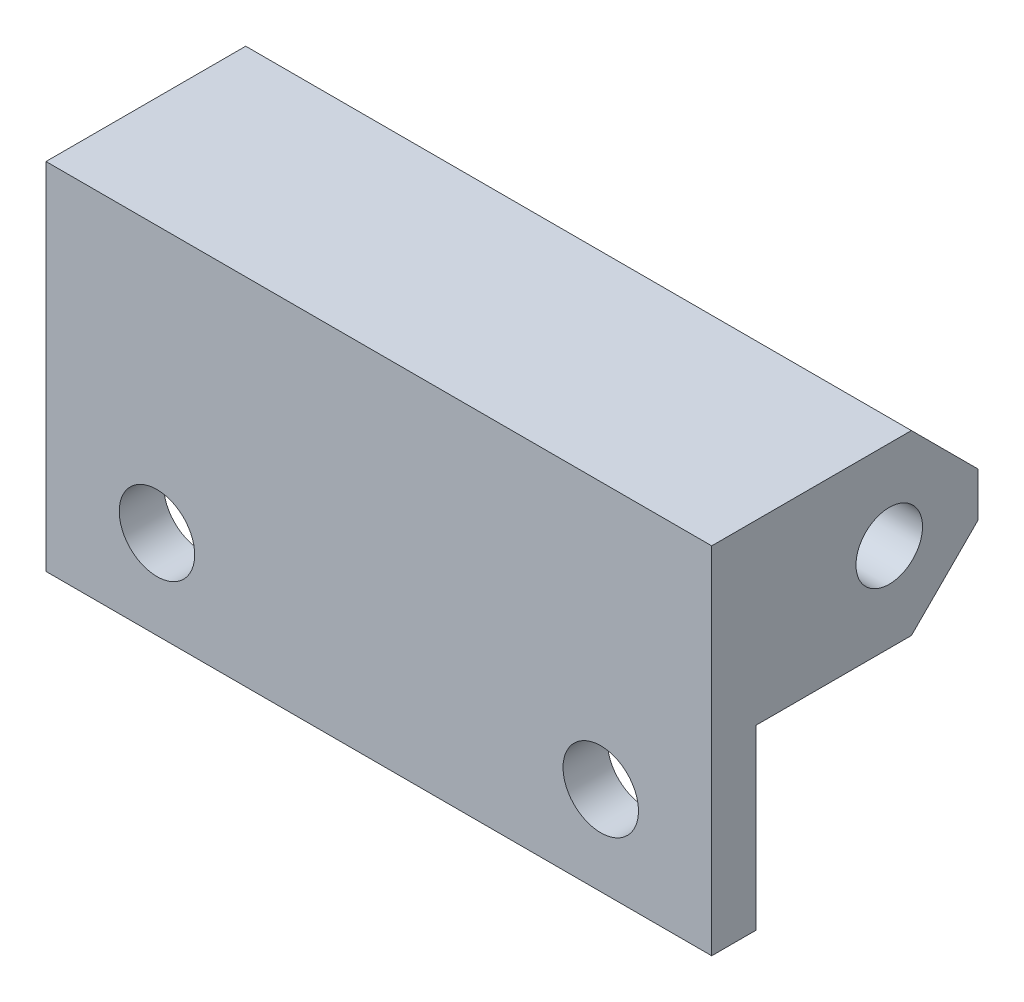
ISO-10303-21;
HEADER;
FILE_DESCRIPTION(('STEP AP214'),'2;1');
FILE_NAME('part.step','',(''),(''),'','','');
FILE_SCHEMA(('AUTOMOTIVE_DESIGN { 1 0 10303 214 1 1 1 1 }'));
ENDSEC;
DATA;
#1=APPLICATION_CONTEXT('core data for automotive mechanical design processes');
#2=APPLICATION_PROTOCOL_DEFINITION('international standard','automotive_design',2000,#1);
#3=PRODUCT_CONTEXT('',#1,'mechanical');
#4=PRODUCT('Part','Part','',(#3));
#5=PRODUCT_RELATED_PRODUCT_CATEGORY('part','',(#4));
#6=PRODUCT_DEFINITION_FORMATION('','',#4);
#7=PRODUCT_DEFINITION_CONTEXT('part definition',#1,'design');
#8=PRODUCT_DEFINITION('design','',#6,#7);
#9=PRODUCT_DEFINITION_SHAPE('','',#8);
#10=(LENGTH_UNIT() NAMED_UNIT(*) SI_UNIT(.MILLI.,.METRE.));
#11=(NAMED_UNIT(*) PLANE_ANGLE_UNIT() SI_UNIT($,.RADIAN.));
#12=(NAMED_UNIT(*) SI_UNIT($,.STERADIAN.) SOLID_ANGLE_UNIT());
#13=UNCERTAINTY_MEASURE_WITH_UNIT(LENGTH_MEASURE(1.E-05),#10,'distance_accuracy_value','');
#14=(GEOMETRIC_REPRESENTATION_CONTEXT(3) GLOBAL_UNCERTAINTY_ASSIGNED_CONTEXT((#13)) GLOBAL_UNIT_ASSIGNED_CONTEXT((#10,
#11,#12)) REPRESENTATION_CONTEXT('',''));
#15=CARTESIAN_POINT('',(0.,0.,0.));
#16=DIRECTION('',(0.,0.,1.));
#17=DIRECTION('',(1.,0.,0.));
#18=AXIS2_PLACEMENT_3D('',#15,#16,#17);
#19=CARTESIAN_POINT('',(15.,3.,-4.));
#20=DIRECTION('',(0.,-0.707106781186547,-0.707106781186548));
#21=DIRECTION('',(0.,0.707106781186548,-0.707106781186547));
#22=AXIS2_PLACEMENT_3D('',#19,#20,#21);
#23=PLANE('',#22);
#24=DIRECTION('',(0.,-0.707106781186548,0.707106781186547));
#25=VECTOR('',#24,1.);
#26=CARTESIAN_POINT('',(-15.,3.,-4.));
#27=LINE('',#26,#25);
#28=CARTESIAN_POINT('',(-15.,3.,-4.));
#29=VERTEX_POINT('',#28);
#30=CARTESIAN_POINT('',(-15.,0.,-1.));
#31=VERTEX_POINT('',#30);
#32=EDGE_CURVE('E144',#29,#31,#27,.T.);
#33=ORIENTED_EDGE('',*,*,#32,.F.);
#34=DIRECTION('',(-1.,0.,0.));
#35=VECTOR('',#34,1.);
#36=CARTESIAN_POINT('',(15.,3.,-4.));
#37=LINE('',#36,#35);
#38=CARTESIAN_POINT('',(15.,3.,-4.));
#39=VERTEX_POINT('',#38);
#40=EDGE_CURVE('E42',#39,#29,#37,.T.);
#41=ORIENTED_EDGE('',*,*,#40,.F.);
#42=DIRECTION('',(0.,-0.707106781186548,0.707106781186547));
#43=VECTOR('',#42,1.);
#44=CARTESIAN_POINT('',(15.,3.,-4.));
#45=LINE('',#44,#43);
#46=CARTESIAN_POINT('',(15.,0.,-1.));
#47=VERTEX_POINT('',#46);
#48=EDGE_CURVE('E116',#39,#47,#45,.T.);
#49=ORIENTED_EDGE('',*,*,#48,.T.);
#50=DIRECTION('',(-1.,0.,0.));
#51=VECTOR('',#50,1.);
#52=CARTESIAN_POINT('',(15.,0.,-1.));
#53=LINE('',#52,#51);
#54=EDGE_CURVE('E11',#47,#31,#53,.T.);
#55=ORIENTED_EDGE('',*,*,#54,.T.);
#56=EDGE_LOOP('',(#33,#41,#49,#55));
#57=FACE_BOUND('',#56,.T.);
#58=ADVANCED_FACE('F32',(#57),#23,.T.);
#59=CARTESIAN_POINT('',(15.,5.,-4.));
#60=DIRECTION('',(0.,0.,-1.));
#61=DIRECTION('',(0.,1.,0.));
#62=AXIS2_PLACEMENT_3D('',#59,#60,#61);
#63=PLANE('',#62);
#64=DIRECTION('',(0.,-1.,0.));
#65=VECTOR('',#64,1.);
#66=CARTESIAN_POINT('',(-15.,5.,-4.));
#67=LINE('',#66,#65);
#68=CARTESIAN_POINT('',(-15.,5.,-4.));
#69=VERTEX_POINT('',#68);
#70=EDGE_CURVE('E103',#69,#29,#67,.T.);
#71=ORIENTED_EDGE('',*,*,#70,.F.);
#72=DIRECTION('',(-1.,0.,0.));
#73=VECTOR('',#72,1.);
#74=CARTESIAN_POINT('',(15.,5.,-4.));
#75=LINE('',#74,#73);
#76=CARTESIAN_POINT('',(15.,5.,-4.));
#77=VERTEX_POINT('',#76);
#78=EDGE_CURVE('E98',#77,#69,#75,.T.);
#79=ORIENTED_EDGE('',*,*,#78,.F.);
#80=DIRECTION('',(0.,-1.,0.));
#81=VECTOR('',#80,1.);
#82=CARTESIAN_POINT('',(15.,5.,-4.));
#83=LINE('',#82,#81);
#84=EDGE_CURVE('E101',#77,#39,#83,.T.);
#85=ORIENTED_EDGE('',*,*,#84,.T.);
#86=ORIENTED_EDGE('',*,*,#40,.T.);
#87=EDGE_LOOP('',(#71,#79,#85,#86));
#88=FACE_BOUND('',#87,.T.);
#89=ADVANCED_FACE('F100',(#88),#63,.T.);
#90=CARTESIAN_POINT('',(15.,8.,-0.999999999999999));
#91=DIRECTION('',(0.,0.707106781186547,-0.707106781186547));
#92=DIRECTION('',(0.,0.707106781186548,0.707106781186548));
#93=AXIS2_PLACEMENT_3D('',#90,#91,#92);
#94=PLANE('',#93);
#95=DIRECTION('',(0.,-0.707106781186548,-0.707106781186548));
#96=VECTOR('',#95,1.);
#97=CARTESIAN_POINT('',(-15.,8.,-0.999999999999999));
#98=LINE('',#97,#96);
#99=CARTESIAN_POINT('',(-15.,8.,-0.999999999999999));
#100=VERTEX_POINT('',#99);
#101=EDGE_CURVE('E141',#100,#69,#98,.T.);
#102=ORIENTED_EDGE('',*,*,#101,.F.);
#103=DIRECTION('',(-1.,0.,0.));
#104=VECTOR('',#103,1.);
#105=CARTESIAN_POINT('',(15.,8.,-0.999999999999999));
#106=LINE('',#105,#104);
#107=CARTESIAN_POINT('',(15.,8.,-0.999999999999999));
#108=VERTEX_POINT('',#107);
#109=EDGE_CURVE('E108',#108,#100,#106,.T.);
#110=ORIENTED_EDGE('',*,*,#109,.F.);
#111=DIRECTION('',(0.,-0.707106781186548,-0.707106781186548));
#112=VECTOR('',#111,1.);
#113=CARTESIAN_POINT('',(15.,8.,-0.999999999999999));
#114=LINE('',#113,#112);
#115=EDGE_CURVE('E114',#108,#77,#114,.T.);
#116=ORIENTED_EDGE('',*,*,#115,.T.);
#117=ORIENTED_EDGE('',*,*,#78,.T.);
#118=EDGE_LOOP('',(#102,#110,#116,#117));
#119=FACE_BOUND('',#118,.T.);
#120=ADVANCED_FACE('F119',(#119),#94,.T.);
#121=CARTESIAN_POINT('',(15.,8.,0.));
#122=DIRECTION('',(0.,1.,0.));
#123=DIRECTION('',(0.,0.,1.));
#124=AXIS2_PLACEMENT_3D('',#121,#122,#123);
#125=PLANE('',#124);
#126=DIRECTION('',(0.,0.,-1.));
#127=VECTOR('',#126,1.);
#128=CARTESIAN_POINT('',(-15.,8.,0.));
#129=LINE('',#128,#127);
#130=CARTESIAN_POINT('',(-15.,8.,8.));
#131=VERTEX_POINT('',#130);
#132=EDGE_CURVE('E138',#131,#100,#129,.T.);
#133=ORIENTED_EDGE('',*,*,#132,.F.);
#134=DIRECTION('',(-1.,0.,0.));
#135=VECTOR('',#134,1.);
#136=CARTESIAN_POINT('',(15.,8.,8.));
#137=LINE('',#136,#135);
#138=CARTESIAN_POINT('',(15.,8.,8.));
#139=VERTEX_POINT('',#138);
#140=EDGE_CURVE('E149',#139,#131,#137,.T.);
#141=ORIENTED_EDGE('',*,*,#140,.F.);
#142=DIRECTION('',(0.,0.,-1.));
#143=VECTOR('',#142,1.);
#144=CARTESIAN_POINT('',(15.,8.,8.));
#145=LINE('',#144,#143);
#146=EDGE_CURVE('E120',#139,#108,#145,.T.);
#147=ORIENTED_EDGE('',*,*,#146,.T.);
#148=ORIENTED_EDGE('',*,*,#109,.T.);
#149=EDGE_LOOP('',(#133,#141,#147,#148));
#150=FACE_BOUND('',#149,.T.);
#151=ADVANCED_FACE('F175',(#150),#125,.T.);
#152=CARTESIAN_POINT('',(15.,-8.,8.));
#153=DIRECTION('',(0.,0.,1.));
#154=DIRECTION('',(1.,0.,0.));
#155=AXIS2_PLACEMENT_3D('',#152,#153,#154);
#156=PLANE('',#155);
#157=CARTESIAN_POINT('',(10.,-4.,8.));
#158=DIRECTION('',(0.,0.,-1.));
#159=DIRECTION('',(0.,1.,0.));
#160=AXIS2_PLACEMENT_3D('',#157,#158,#159);
#161=CIRCLE('',#160,1.7);
#162=CARTESIAN_POINT('',(10.,-2.3,8.));
#163=VERTEX_POINT('',#162);
#164=EDGE_CURVE('E199',#163,#163,#161,.T.);
#165=ORIENTED_EDGE('',*,*,#164,.T.);
#166=EDGE_LOOP('',(#165));
#167=FACE_BOUND('',#166,.T.);
#168=CARTESIAN_POINT('',(-10.,-4.,8.));
#169=DIRECTION('',(0.,0.,-1.));
#170=DIRECTION('',(0.,1.,0.));
#171=AXIS2_PLACEMENT_3D('',#168,#169,#170);
#172=CIRCLE('',#171,1.7);
#173=CARTESIAN_POINT('',(-10.,-2.3,8.));
#174=VERTEX_POINT('',#173);
#175=EDGE_CURVE('E129',#174,#174,#172,.T.);
#176=ORIENTED_EDGE('',*,*,#175,.T.);
#177=EDGE_LOOP('',(#176));
#178=FACE_BOUND('',#177,.T.);
#179=DIRECTION('',(0.,1.,0.));
#180=VECTOR('',#179,1.);
#181=CARTESIAN_POINT('',(-15.,-8.,8.));
#182=LINE('',#181,#180);
#183=CARTESIAN_POINT('',(-15.,-8.,8.));
#184=VERTEX_POINT('',#183);
#185=EDGE_CURVE('E135',#184,#131,#182,.T.);
#186=ORIENTED_EDGE('',*,*,#185,.F.);
#187=DIRECTION('',(-1.,0.,0.));
#188=VECTOR('',#187,1.);
#189=CARTESIAN_POINT('',(15.,-8.,8.));
#190=LINE('',#189,#188);
#191=CARTESIAN_POINT('',(15.,-8.,8.));
#192=VERTEX_POINT('',#191);
#193=EDGE_CURVE('E152',#192,#184,#190,.T.);
#194=ORIENTED_EDGE('',*,*,#193,.F.);
#195=DIRECTION('',(0.,1.,0.));
#196=VECTOR('',#195,1.);
#197=CARTESIAN_POINT('',(15.,-8.,8.));
#198=LINE('',#197,#196);
#199=EDGE_CURVE('E122',#192,#139,#198,.T.);
#200=ORIENTED_EDGE('',*,*,#199,.T.);
#201=ORIENTED_EDGE('',*,*,#140,.T.);
#202=EDGE_LOOP('',(#186,#194,#200,#201));
#203=FACE_BOUND('',#202,.T.);
#204=ADVANCED_FACE('F178',(#167,#178,#203),#156,.T.);
#205=CARTESIAN_POINT('',(15.,-8.,6.));
#206=DIRECTION('',(0.,-1.,0.));
#207=DIRECTION('',(0.,0.,-1.));
#208=AXIS2_PLACEMENT_3D('',#205,#206,#207);
#209=PLANE('',#208);
#210=DIRECTION('',(0.,0.,1.));
#211=VECTOR('',#210,1.);
#212=CARTESIAN_POINT('',(-15.,-8.,6.));
#213=LINE('',#212,#211);
#214=CARTESIAN_POINT('',(-15.,-8.,6.));
#215=VERTEX_POINT('',#214);
#216=EDGE_CURVE('E132',#215,#184,#213,.T.);
#217=ORIENTED_EDGE('',*,*,#216,.F.);
#218=DIRECTION('',(-1.,0.,0.));
#219=VECTOR('',#218,1.);
#220=CARTESIAN_POINT('',(15.,-8.,6.));
#221=LINE('',#220,#219);
#222=CARTESIAN_POINT('',(15.,-8.,6.));
#223=VERTEX_POINT('',#222);
#224=EDGE_CURVE('E153',#223,#215,#221,.T.);
#225=ORIENTED_EDGE('',*,*,#224,.F.);
#226=DIRECTION('',(0.,0.,1.));
#227=VECTOR('',#226,1.);
#228=CARTESIAN_POINT('',(15.,-8.,6.));
#229=LINE('',#228,#227);
#230=EDGE_CURVE('E210',#223,#192,#229,.T.);
#231=ORIENTED_EDGE('',*,*,#230,.T.);
#232=ORIENTED_EDGE('',*,*,#193,.T.);
#233=EDGE_LOOP('',(#217,#225,#231,#232));
#234=FACE_BOUND('',#233,.T.);
#235=ADVANCED_FACE('F182',(#234),#209,.T.);
#236=CARTESIAN_POINT('',(15.,0.,6.));
#237=DIRECTION('',(0.,0.,-1.));
#238=DIRECTION('',(0.,1.,0.));
#239=AXIS2_PLACEMENT_3D('',#236,#237,#238);
#240=PLANE('',#239);
#241=CARTESIAN_POINT('',(10.,-4.,6.));
#242=DIRECTION('',(0.,0.,-1.));
#243=DIRECTION('',(0.,1.,0.));
#244=AXIS2_PLACEMENT_3D('',#241,#242,#243);
#245=CIRCLE('',#244,1.7);
#246=CARTESIAN_POINT('',(10.,-2.3,6.));
#247=VERTEX_POINT('',#246);
#248=EDGE_CURVE('E194',#247,#247,#245,.T.);
#249=ORIENTED_EDGE('',*,*,#248,.F.);
#250=EDGE_LOOP('',(#249));
#251=FACE_BOUND('',#250,.T.);
#252=CARTESIAN_POINT('',(-10.,-4.,6.));
#253=DIRECTION('',(0.,0.,-1.));
#254=DIRECTION('',(0.,1.,0.));
#255=AXIS2_PLACEMENT_3D('',#252,#253,#254);
#256=CIRCLE('',#255,1.7);
#257=CARTESIAN_POINT('',(-10.,-2.3,6.));
#258=VERTEX_POINT('',#257);
#259=EDGE_CURVE('E197',#258,#258,#256,.T.);
#260=ORIENTED_EDGE('',*,*,#259,.F.);
#261=EDGE_LOOP('',(#260));
#262=FACE_BOUND('',#261,.T.);
#263=DIRECTION('',(0.,-1.,0.));
#264=VECTOR('',#263,1.);
#265=CARTESIAN_POINT('',(-15.,0.,6.));
#266=LINE('',#265,#264);
#267=CARTESIAN_POINT('',(-15.,0.,6.));
#268=VERTEX_POINT('',#267);
#269=EDGE_CURVE('E128',#268,#215,#266,.T.);
#270=ORIENTED_EDGE('',*,*,#269,.F.);
#271=DIRECTION('',(-1.,0.,0.));
#272=VECTOR('',#271,1.);
#273=CARTESIAN_POINT('',(15.,0.,6.));
#274=LINE('',#273,#272);
#275=CARTESIAN_POINT('',(15.,0.,6.));
#276=VERTEX_POINT('',#275);
#277=EDGE_CURVE('E36',#276,#268,#274,.T.);
#278=ORIENTED_EDGE('',*,*,#277,.F.);
#279=DIRECTION('',(0.,-1.,0.));
#280=VECTOR('',#279,1.);
#281=CARTESIAN_POINT('',(15.,0.,6.));
#282=LINE('',#281,#280);
#283=EDGE_CURVE('E208',#276,#223,#282,.T.);
#284=ORIENTED_EDGE('',*,*,#283,.T.);
#285=ORIENTED_EDGE('',*,*,#224,.T.);
#286=EDGE_LOOP('',(#270,#278,#284,#285));
#287=FACE_BOUND('',#286,.T.);
#288=ADVANCED_FACE('F159',(#251,#262,#287),#240,.T.);
#289=CARTESIAN_POINT('',(15.,0.,0.));
#290=DIRECTION('',(0.,-1.,0.));
#291=DIRECTION('',(0.,0.,-1.));
#292=AXIS2_PLACEMENT_3D('',#289,#290,#291);
#293=PLANE('',#292);
#294=DIRECTION('',(0.,0.,1.));
#295=VECTOR('',#294,1.);
#296=CARTESIAN_POINT('',(-15.,0.,0.));
#297=LINE('',#296,#295);
#298=EDGE_CURVE('E81',#31,#268,#297,.T.);
#299=ORIENTED_EDGE('',*,*,#298,.F.);
#300=ORIENTED_EDGE('',*,*,#54,.F.);
#301=DIRECTION('',(0.,0.,1.));
#302=VECTOR('',#301,1.);
#303=CARTESIAN_POINT('',(15.,0.,-1.));
#304=LINE('',#303,#302);
#305=EDGE_CURVE('E84',#47,#276,#304,.T.);
#306=ORIENTED_EDGE('',*,*,#305,.T.);
#307=ORIENTED_EDGE('',*,*,#277,.T.);
#308=EDGE_LOOP('',(#299,#300,#306,#307));
#309=FACE_BOUND('',#308,.T.);
#310=ADVANCED_FACE('F34',(#309),#293,.T.);
#311=CARTESIAN_POINT('',(15.,0.,0.));
#312=DIRECTION('',(1.,0.,0.));
#313=DIRECTION('',(0.,0.,-1.));
#314=AXIS2_PLACEMENT_3D('',#311,#312,#313);
#315=PLANE('',#314);
#316=CARTESIAN_POINT('',(15.,4.,0.));
#317=DIRECTION('',(1.,0.,0.));
#318=DIRECTION('',(0.,0.,-1.));
#319=AXIS2_PLACEMENT_3D('',#316,#317,#318);
#320=CIRCLE('',#319,1.5);
#321=CARTESIAN_POINT('',(15.,4.,-1.5));
#322=VERTEX_POINT('',#321);
#323=EDGE_CURVE('E218',#322,#322,#320,.T.);
#324=ORIENTED_EDGE('',*,*,#323,.F.);
#325=EDGE_LOOP('',(#324));
#326=FACE_BOUND('',#325,.T.);
#327=ORIENTED_EDGE('',*,*,#305,.F.);
#328=ORIENTED_EDGE('',*,*,#48,.F.);
#329=ORIENTED_EDGE('',*,*,#84,.F.);
#330=ORIENTED_EDGE('',*,*,#115,.F.);
#331=ORIENTED_EDGE('',*,*,#146,.F.);
#332=ORIENTED_EDGE('',*,*,#199,.F.);
#333=ORIENTED_EDGE('',*,*,#230,.F.);
#334=ORIENTED_EDGE('',*,*,#283,.F.);
#335=EDGE_LOOP('',(#327,#328,#329,#330,#331,#332,#333,#334));
#336=FACE_BOUND('',#335,.T.);
#337=ADVANCED_FACE('F112',(#326,#336),#315,.T.);
#338=CARTESIAN_POINT('',(-15.,0.,0.));
#339=DIRECTION('',(1.,0.,0.));
#340=DIRECTION('',(0.,0.,-1.));
#341=AXIS2_PLACEMENT_3D('',#338,#339,#340);
#342=PLANE('',#341);
#343=CARTESIAN_POINT('',(-15.,4.,0.));
#344=DIRECTION('',(1.,0.,0.));
#345=DIRECTION('',(0.,0.,-1.));
#346=AXIS2_PLACEMENT_3D('',#343,#344,#345);
#347=CIRCLE('',#346,1.5);
#348=CARTESIAN_POINT('',(-15.,4.,-1.5));
#349=VERTEX_POINT('',#348);
#350=EDGE_CURVE('E221',#349,#349,#347,.T.);
#351=ORIENTED_EDGE('',*,*,#350,.T.);
#352=EDGE_LOOP('',(#351));
#353=FACE_BOUND('',#352,.T.);
#354=ORIENTED_EDGE('',*,*,#32,.T.);
#355=ORIENTED_EDGE('',*,*,#298,.T.);
#356=ORIENTED_EDGE('',*,*,#269,.T.);
#357=ORIENTED_EDGE('',*,*,#216,.T.);
#358=ORIENTED_EDGE('',*,*,#185,.T.);
#359=ORIENTED_EDGE('',*,*,#132,.T.);
#360=ORIENTED_EDGE('',*,*,#101,.T.);
#361=ORIENTED_EDGE('',*,*,#70,.T.);
#362=EDGE_LOOP('',(#354,#355,#356,#357,#358,#359,#360,#361));
#363=FACE_BOUND('',#362,.T.);
#364=ADVANCED_FACE('F161',(#353,#363),#342,.F.);
#365=CARTESIAN_POINT('',(-10.,-4.,6.));
#366=DIRECTION('',(0.,0.,-1.));
#367=DIRECTION('',(0.,1.,0.));
#368=AXIS2_PLACEMENT_3D('',#365,#366,#367);
#369=CYLINDRICAL_SURFACE('',#368,1.7);
#370=ORIENTED_EDGE('',*,*,#175,.F.);
#371=EDGE_LOOP('',(#370));
#372=FACE_BOUND('',#371,.T.);
#373=ORIENTED_EDGE('',*,*,#259,.T.);
#374=EDGE_LOOP('',(#373));
#375=FACE_BOUND('',#374,.T.);
#376=ADVANCED_FACE('F234',(#372,#375),#369,.F.);
#377=CARTESIAN_POINT('',(10.,-4.,6.));
#378=DIRECTION('',(0.,0.,-1.));
#379=DIRECTION('',(0.,1.,0.));
#380=AXIS2_PLACEMENT_3D('',#377,#378,#379);
#381=CYLINDRICAL_SURFACE('',#380,1.7);
#382=ORIENTED_EDGE('',*,*,#164,.F.);
#383=EDGE_LOOP('',(#382));
#384=FACE_BOUND('',#383,.T.);
#385=ORIENTED_EDGE('',*,*,#248,.T.);
#386=EDGE_LOOP('',(#385));
#387=FACE_BOUND('',#386,.T.);
#388=ADVANCED_FACE('F228',(#384,#387),#381,.F.);
#389=CARTESIAN_POINT('',(-15.,4.,0.));
#390=DIRECTION('',(1.,0.,0.));
#391=DIRECTION('',(0.,0.,-1.));
#392=AXIS2_PLACEMENT_3D('',#389,#390,#391);
#393=CYLINDRICAL_SURFACE('',#392,1.5);
#394=ORIENTED_EDGE('',*,*,#323,.T.);
#395=EDGE_LOOP('',(#394));
#396=FACE_BOUND('',#395,.T.);
#397=ORIENTED_EDGE('',*,*,#350,.F.);
#398=EDGE_LOOP('',(#397));
#399=FACE_BOUND('',#398,.T.);
#400=ADVANCED_FACE('F226',(#396,#399),#393,.F.);
#401=CLOSED_SHELL('',(#58,#89,#120,#151,#204,#235,#288,#310,#337,#364,#376,#388,#400));
#402=MANIFOLD_SOLID_BREP('B2',#401);
#403=ADVANCED_BREP_SHAPE_REPRESENTATION('',(#18,#402),#14);
#404=SHAPE_DEFINITION_REPRESENTATION(#9,#403);
ENDSEC;
END-ISO-10303-21;
